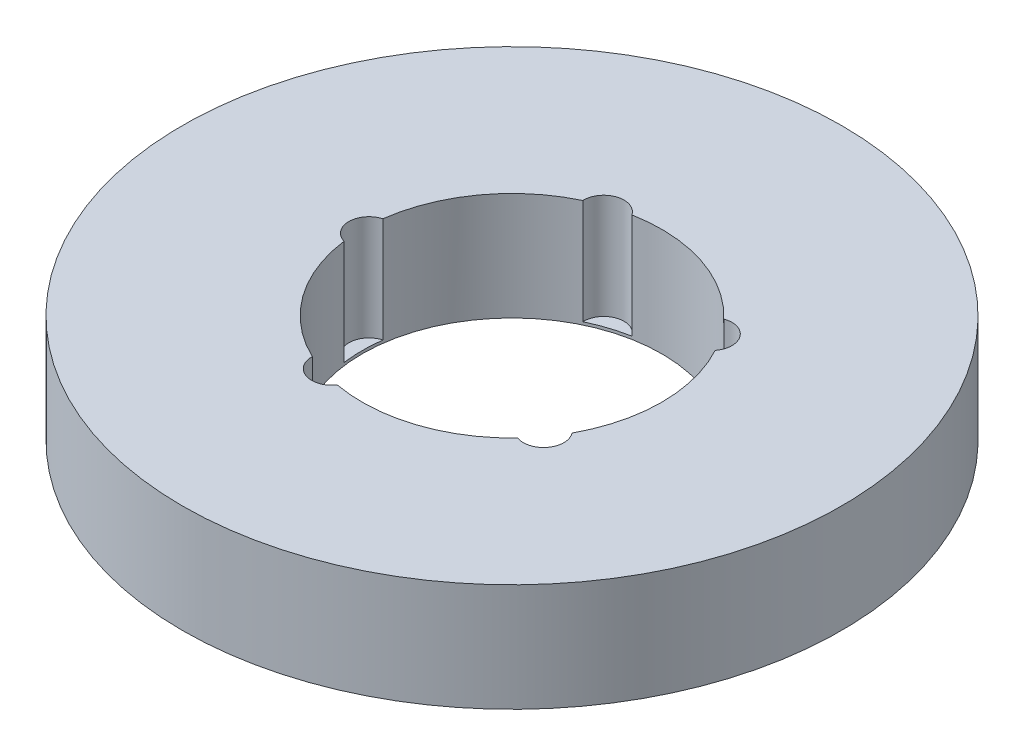
ISO-10303-21;
HEADER;
FILE_DESCRIPTION(('STEP AP214'),'2;1');
FILE_NAME('part.step','',(''),(''),'','','');
FILE_SCHEMA(('AUTOMOTIVE_DESIGN { 1 0 10303 214 1 1 1 1 }'));
ENDSEC;
DATA;
#1=APPLICATION_CONTEXT('core data for automotive mechanical design processes');
#2=APPLICATION_PROTOCOL_DEFINITION('international standard','automotive_design',2000,#1);
#3=PRODUCT_CONTEXT('',#1,'mechanical');
#4=PRODUCT('Part','Part','',(#3));
#5=PRODUCT_RELATED_PRODUCT_CATEGORY('part','',(#4));
#6=PRODUCT_DEFINITION_FORMATION('','',#4);
#7=PRODUCT_DEFINITION_CONTEXT('part definition',#1,'design');
#8=PRODUCT_DEFINITION('design','',#6,#7);
#9=PRODUCT_DEFINITION_SHAPE('','',#8);
#10=(LENGTH_UNIT() NAMED_UNIT(*) SI_UNIT(.MILLI.,.METRE.));
#11=(NAMED_UNIT(*) PLANE_ANGLE_UNIT() SI_UNIT($,.RADIAN.));
#12=(NAMED_UNIT(*) SI_UNIT($,.STERADIAN.) SOLID_ANGLE_UNIT());
#13=UNCERTAINTY_MEASURE_WITH_UNIT(LENGTH_MEASURE(1.E-05),#10,'distance_accuracy_value','');
#14=(GEOMETRIC_REPRESENTATION_CONTEXT(3) GLOBAL_UNCERTAINTY_ASSIGNED_CONTEXT((#13)) GLOBAL_UNIT_ASSIGNED_CONTEXT((#10,
#11,#12)) REPRESENTATION_CONTEXT('',''));
#15=CARTESIAN_POINT('',(0.,0.,0.));
#16=DIRECTION('',(0.,0.,1.));
#17=DIRECTION('',(1.,0.,0.));
#18=AXIS2_PLACEMENT_3D('',#15,#16,#17);
#19=CARTESIAN_POINT('',(0.,27.,0.));
#20=DIRECTION('',(0.,-1.,0.));
#21=DIRECTION('',(0.,0.,-1.));
#22=AXIS2_PLACEMENT_3D('',#19,#20,#21);
#23=CYLINDRICAL_SURFACE('',#22,82.5);
#24=CARTESIAN_POINT('',(0.,27.,0.));
#25=DIRECTION('',(0.,1.,0.));
#26=DIRECTION('',(0.,0.,1.));
#27=AXIS2_PLACEMENT_3D('',#24,#25,#26);
#28=CIRCLE('',#27,82.5);
#29=CARTESIAN_POINT('',(0.,27.,82.5));
#30=VERTEX_POINT('',#29);
#31=EDGE_CURVE('E159',#30,#30,#28,.T.);
#32=ORIENTED_EDGE('',*,*,#31,.F.);
#33=EDGE_LOOP('',(#32));
#34=FACE_BOUND('',#33,.T.);
#35=CARTESIAN_POINT('',(0.,0.,0.));
#36=DIRECTION('',(0.,1.,0.));
#37=DIRECTION('',(0.,0.,1.));
#38=AXIS2_PLACEMENT_3D('',#35,#36,#37);
#39=CIRCLE('',#38,82.5);
#40=CARTESIAN_POINT('',(0.,0.,82.5));
#41=VERTEX_POINT('',#40);
#42=EDGE_CURVE('E152',#41,#41,#39,.T.);
#43=ORIENTED_EDGE('',*,*,#42,.T.);
#44=EDGE_LOOP('',(#43));
#45=FACE_BOUND('',#44,.T.);
#46=ADVANCED_FACE('F39',(#34,#45),#23,.T.);
#47=CARTESIAN_POINT('',(0.,27.,0.));
#48=DIRECTION('',(0.,1.,0.));
#49=DIRECTION('',(0.,0.,1.));
#50=AXIS2_PLACEMENT_3D('',#47,#48,#49);
#51=PLANE('',#50);
#52=CARTESIAN_POINT('',(-11.0580663244745,27.,34.0332286798276));
#53=DIRECTION('',(0.,1.,0.));
#54=DIRECTION('',(0.951056516295155,0.,0.309016994374945));
#55=AXIS2_PLACEMENT_3D('',#52,#53,#54);
#56=CIRCLE('',#55,5.06944464076834);
#57=CARTESIAN_POINT('',(-16.1244245333742,27.,33.8563573567435));
#58=VERTEX_POINT('',#57);
#59=CARTESIAN_POINT('',(-6.85533407862134,27.,36.8680674116571));
#60=VERTEX_POINT('',#59);
#61=EDGE_CURVE('E192',#58,#60,#56,.T.);
#62=ORIENTED_EDGE('',*,*,#61,.F.);
#63=CARTESIAN_POINT('',(0.,27.,0.));
#64=DIRECTION('',(0.,1.,0.));
#65=DIRECTION('',(0.,0.,1.));
#66=AXIS2_PLACEMENT_3D('',#63,#64,#65);
#67=CIRCLE('',#66,37.5);
#68=CARTESIAN_POINT('',(-37.1820304874772,27.,4.87304923311006));
#69=VERTEX_POINT('',#68);
#70=EDGE_CURVE('E147',#69,#58,#67,.T.);
#71=ORIENTED_EDGE('',*,*,#70,.F.);
#72=CARTESIAN_POINT('',(-35.784654325701,27.,0.));
#73=DIRECTION('',(0.,1.,0.));
#74=DIRECTION('',(0.,0.,1.));
#75=AXIS2_PLACEMENT_3D('',#72,#73,#74);
#76=CIRCLE('',#75,5.06944464076834);
#77=CARTESIAN_POINT('',(-37.1820304874772,27.,-4.87304923311006));
#78=VERTEX_POINT('',#77);
#79=EDGE_CURVE('E154',#78,#69,#76,.T.);
#80=ORIENTED_EDGE('',*,*,#79,.F.);
#81=CARTESIAN_POINT('',(-16.1244245333747,27.,-33.8563573567433));
#82=VERTEX_POINT('',#81);
#83=EDGE_CURVE('E136',#82,#78,#67,.T.);
#84=ORIENTED_EDGE('',*,*,#83,.F.);
#85=CARTESIAN_POINT('',(-11.058066324475,27.,-34.0332286798274));
#86=DIRECTION('',(0.,1.,0.));
#87=DIRECTION('',(-0.95105651629515,0.,0.309016994374958));
#88=AXIS2_PLACEMENT_3D('',#85,#86,#87);
#89=CIRCLE('',#88,5.06944464076834);
#90=CARTESIAN_POINT('',(-6.85533407862186,27.,-36.868067411657));
#91=VERTEX_POINT('',#90);
#92=EDGE_CURVE('E117',#91,#82,#89,.T.);
#93=ORIENTED_EDGE('',*,*,#92,.F.);
#94=CARTESIAN_POINT('',(27.216588076819,27.,-25.7974288148403));
#95=VERTEX_POINT('',#94);
#96=EDGE_CURVE('E133',#95,#91,#67,.T.);
#97=ORIENTED_EDGE('',*,*,#96,.F.);
#98=CARTESIAN_POINT('',(28.9503934873249,27.,-21.0336920710314));
#99=DIRECTION('',(0.,1.,0.));
#100=DIRECTION('',(-0.58778525229248,0.,-0.809016994374942));
#101=AXIS2_PLACEMENT_3D('',#98,#99,#100);
#102=CIRCLE('',#101,5.06944464076834);
#103=CARTESIAN_POINT('',(32.9452010226536,27.,-17.9126695268167));
#104=VERTEX_POINT('',#103);
#105=EDGE_CURVE('E333',#104,#95,#102,.T.);
#106=ORIENTED_EDGE('',*,*,#105,.F.);
#107=CARTESIAN_POINT('',(32.9452010226538,27.,17.9126695268162));
#108=VERTEX_POINT('',#107);
#109=EDGE_CURVE('E144',#108,#104,#67,.T.);
#110=ORIENTED_EDGE('',*,*,#109,.F.);
#111=CARTESIAN_POINT('',(28.9503934873252,27.,21.033692071031));
#112=DIRECTION('',(0.,1.,0.));
#113=DIRECTION('',(0.587785252292469,0.,-0.809016994374951));
#114=AXIS2_PLACEMENT_3D('',#111,#112,#113);
#115=CIRCLE('',#114,5.06944464076834);
#116=CARTESIAN_POINT('',(27.2165880768194,27.,25.7974288148399));
#117=VERTEX_POINT('',#116);
#118=EDGE_CURVE('E328',#117,#108,#115,.T.);
#119=ORIENTED_EDGE('',*,*,#118,.F.);
#120=EDGE_CURVE('E146',#60,#117,#67,.T.);
#121=ORIENTED_EDGE('',*,*,#120,.F.);
#122=EDGE_LOOP('',(#62,#71,#80,#84,#93,#97,#106,#110,#119,#121));
#123=FACE_BOUND('',#122,.T.);
#124=ORIENTED_EDGE('',*,*,#31,.T.);
#125=EDGE_LOOP('',(#124));
#126=FACE_BOUND('',#125,.T.);
#127=ADVANCED_FACE('F131',(#123,#126),#51,.T.);
#128=CARTESIAN_POINT('',(0.,0.,0.));
#129=DIRECTION('',(0.,1.,0.));
#130=DIRECTION('',(0.,0.,1.));
#131=AXIS2_PLACEMENT_3D('',#128,#129,#130);
#132=PLANE('',#131);
#133=CARTESIAN_POINT('',(0.,0.,0.));
#134=DIRECTION('',(0.,1.,0.));
#135=DIRECTION('',(0.,0.,1.));
#136=AXIS2_PLACEMENT_3D('',#133,#134,#135);
#137=CIRCLE('',#136,37.5);
#138=CARTESIAN_POINT('',(0.,0.,37.5));
#139=VERTEX_POINT('',#138);
#140=EDGE_CURVE('E149',#139,#139,#137,.T.);
#141=ORIENTED_EDGE('',*,*,#140,.T.);
#142=EDGE_LOOP('',(#141));
#143=FACE_BOUND('',#142,.T.);
#144=ORIENTED_EDGE('',*,*,#42,.F.);
#145=EDGE_LOOP('',(#144));
#146=FACE_BOUND('',#145,.T.);
#147=ADVANCED_FACE('F209',(#143,#146),#132,.F.);
#148=CARTESIAN_POINT('',(0.,27.,0.));
#149=DIRECTION('',(0.,-1.,0.));
#150=DIRECTION('',(0.,0.,-1.));
#151=AXIS2_PLACEMENT_3D('',#148,#149,#150);
#152=CYLINDRICAL_SURFACE('',#151,37.5);
#153=DIRECTION('',(0.,1.,0.));
#154=VECTOR('',#153,1.);
#155=CARTESIAN_POINT('',(-16.1244245333742,13.8571036078466,33.8563573567435));
#156=LINE('',#155,#154);
#157=CARTESIAN_POINT('',(-16.1244245333742,0.714207215693301,33.8563573567435));
#158=VERTEX_POINT('',#157);
#159=EDGE_CURVE('E11',#158,#58,#156,.T.);
#160=ORIENTED_EDGE('',*,*,#159,.F.);
#161=CARTESIAN_POINT('',(0.,0.714207215693301,0.));
#162=DIRECTION('',(0.,1.,0.));
#163=DIRECTION('',(0.,0.,1.));
#164=AXIS2_PLACEMENT_3D('',#161,#162,#163);
#165=CIRCLE('',#164,37.5);
#166=CARTESIAN_POINT('',(-6.85533407862134,0.714207215693301,36.8680674116571));
#167=VERTEX_POINT('',#166);
#168=EDGE_CURVE('E187',#158,#167,#165,.T.);
#169=ORIENTED_EDGE('',*,*,#168,.T.);
#170=DIRECTION('',(0.,1.,0.));
#171=VECTOR('',#170,1.);
#172=CARTESIAN_POINT('',(-6.85533407862135,13.8571036078466,36.8680674116571));
#173=LINE('',#172,#171);
#174=EDGE_CURVE('E46',#60,#167,#173,.F.);
#175=ORIENTED_EDGE('',*,*,#174,.F.);
#176=ORIENTED_EDGE('',*,*,#120,.T.);
#177=DIRECTION('',(0.,1.,0.));
#178=VECTOR('',#177,1.);
#179=CARTESIAN_POINT('',(27.2165880768194,13.8571036078466,25.7974288148399));
#180=LINE('',#179,#178);
#181=CARTESIAN_POINT('',(27.2165880768194,0.714207215693301,25.7974288148399));
#182=VERTEX_POINT('',#181);
#183=EDGE_CURVE('E186',#182,#117,#180,.T.);
#184=ORIENTED_EDGE('',*,*,#183,.F.);
#185=CARTESIAN_POINT('',(0.,0.714207215693301,0.));
#186=DIRECTION('',(0.,1.,0.));
#187=DIRECTION('',(0.,0.,1.));
#188=AXIS2_PLACEMENT_3D('',#185,#186,#187);
#189=CIRCLE('',#188,37.5);
#190=CARTESIAN_POINT('',(32.9452010226538,0.714207215693301,17.9126695268162));
#191=VERTEX_POINT('',#190);
#192=EDGE_CURVE('E182',#182,#191,#189,.T.);
#193=ORIENTED_EDGE('',*,*,#192,.T.);
#194=DIRECTION('',(0.,1.,0.));
#195=VECTOR('',#194,1.);
#196=CARTESIAN_POINT('',(32.9452010226538,13.8571036078466,17.9126695268162));
#197=LINE('',#196,#195);
#198=EDGE_CURVE('E184',#108,#191,#197,.F.);
#199=ORIENTED_EDGE('',*,*,#198,.F.);
#200=ORIENTED_EDGE('',*,*,#109,.T.);
#201=DIRECTION('',(0.,1.,0.));
#202=VECTOR('',#201,1.);
#203=CARTESIAN_POINT('',(32.9452010226536,13.8571036078466,-17.9126695268167));
#204=LINE('',#203,#202);
#205=CARTESIAN_POINT('',(32.9452010226536,0.714207215693301,-17.9126695268167));
#206=VERTEX_POINT('',#205);
#207=EDGE_CURVE('E178',#206,#104,#204,.T.);
#208=ORIENTED_EDGE('',*,*,#207,.F.);
#209=CARTESIAN_POINT('',(0.,0.714207215693301,0.));
#210=DIRECTION('',(0.,1.,0.));
#211=DIRECTION('',(0.,0.,1.));
#212=AXIS2_PLACEMENT_3D('',#209,#210,#211);
#213=CIRCLE('',#212,37.5);
#214=CARTESIAN_POINT('',(27.216588076819,0.714207215693301,-25.7974288148403));
#215=VERTEX_POINT('',#214);
#216=EDGE_CURVE('E123',#206,#215,#213,.T.);
#217=ORIENTED_EDGE('',*,*,#216,.T.);
#218=DIRECTION('',(0.,1.,0.));
#219=VECTOR('',#218,1.);
#220=CARTESIAN_POINT('',(27.216588076819,13.8571036078466,-25.7974288148403));
#221=LINE('',#220,#219);
#222=EDGE_CURVE('E145',#95,#215,#221,.F.);
#223=ORIENTED_EDGE('',*,*,#222,.F.);
#224=ORIENTED_EDGE('',*,*,#96,.T.);
#225=DIRECTION('',(0.,1.,0.));
#226=VECTOR('',#225,1.);
#227=CARTESIAN_POINT('',(-6.85533407862187,13.8571036078466,-36.868067411657));
#228=LINE('',#227,#226);
#229=CARTESIAN_POINT('',(-6.85533407862186,0.714207215693301,-36.868067411657));
#230=VERTEX_POINT('',#229);
#231=EDGE_CURVE('E111',#230,#91,#228,.T.);
#232=ORIENTED_EDGE('',*,*,#231,.F.);
#233=CARTESIAN_POINT('',(0.,0.714207215693301,0.));
#234=DIRECTION('',(0.,1.,0.));
#235=DIRECTION('',(0.,0.,1.));
#236=AXIS2_PLACEMENT_3D('',#233,#234,#235);
#237=CIRCLE('',#236,37.5);
#238=CARTESIAN_POINT('',(-16.1244245333747,0.714207215693301,-33.8563573567433));
#239=VERTEX_POINT('',#238);
#240=EDGE_CURVE('E173',#230,#239,#237,.T.);
#241=ORIENTED_EDGE('',*,*,#240,.T.);
#242=DIRECTION('',(0.,1.,0.));
#243=VECTOR('',#242,1.);
#244=CARTESIAN_POINT('',(-16.1244245333747,13.8571036078466,-33.8563573567433));
#245=LINE('',#244,#243);
#246=EDGE_CURVE('E124',#82,#239,#245,.F.);
#247=ORIENTED_EDGE('',*,*,#246,.F.);
#248=ORIENTED_EDGE('',*,*,#83,.T.);
#249=DIRECTION('',(0.,1.,0.));
#250=VECTOR('',#249,1.);
#251=CARTESIAN_POINT('',(-37.1820304874772,13.8571036078466,-4.87304923311006));
#252=LINE('',#251,#250);
#253=CARTESIAN_POINT('',(-37.1820304874772,0.714207215693301,-4.87304923311006));
#254=VERTEX_POINT('',#253);
#255=EDGE_CURVE('E171',#254,#78,#252,.T.);
#256=ORIENTED_EDGE('',*,*,#255,.F.);
#257=CARTESIAN_POINT('',(0.,0.714207215693301,0.));
#258=DIRECTION('',(0.,1.,0.));
#259=DIRECTION('',(0.,0.,1.));
#260=AXIS2_PLACEMENT_3D('',#257,#258,#259);
#261=CIRCLE('',#260,37.5);
#262=CARTESIAN_POINT('',(-37.1820304874772,0.714207215693301,4.87304923311006));
#263=VERTEX_POINT('',#262);
#264=EDGE_CURVE('E162',#254,#263,#261,.T.);
#265=ORIENTED_EDGE('',*,*,#264,.T.);
#266=DIRECTION('',(0.,1.,0.));
#267=VECTOR('',#266,1.);
#268=CARTESIAN_POINT('',(-37.1820304874772,13.8571036078466,4.87304923311006));
#269=LINE('',#268,#267);
#270=EDGE_CURVE('E169',#69,#263,#269,.F.);
#271=ORIENTED_EDGE('',*,*,#270,.F.);
#272=ORIENTED_EDGE('',*,*,#70,.T.);
#273=EDGE_LOOP('',(#160,#169,#175,#176,#184,#193,#199,#200,#208,#217,#223,#224,#232,#241,#247,
#248,#256,#265,#271,#272));
#274=FACE_BOUND('',#273,.T.);
#275=ORIENTED_EDGE('',*,*,#140,.F.);
#276=EDGE_LOOP('',(#275));
#277=FACE_BOUND('',#276,.T.);
#278=ADVANCED_FACE('F139',(#274,#277),#152,.F.);
#279=CARTESIAN_POINT('',(-35.784654325701,0.714207215693301,0.));
#280=DIRECTION('',(0.,1.,0.));
#281=DIRECTION('',(0.,0.,1.));
#282=AXIS2_PLACEMENT_3D('',#279,#280,#281);
#283=CYLINDRICAL_SURFACE('',#282,5.06944464076834);
#284=ORIENTED_EDGE('',*,*,#255,.T.);
#285=ORIENTED_EDGE('',*,*,#79,.T.);
#286=ORIENTED_EDGE('',*,*,#270,.T.);
#287=CARTESIAN_POINT('',(-35.784654325701,0.714207215693301,0.));
#288=DIRECTION('',(0.,1.,0.));
#289=DIRECTION('',(0.,0.,1.));
#290=AXIS2_PLACEMENT_3D('',#287,#288,#289);
#291=CIRCLE('',#290,5.06944464076834);
#292=EDGE_CURVE('E157',#254,#263,#291,.T.);
#293=ORIENTED_EDGE('',*,*,#292,.F.);
#294=EDGE_LOOP('',(#284,#285,#286,#293));
#295=FACE_BOUND('',#294,.T.);
#296=ADVANCED_FACE('F222',(#295),#283,.F.);
#297=CARTESIAN_POINT('',(-35.784654325701,0.714207215693301,0.));
#298=DIRECTION('',(0.,1.,0.));
#299=DIRECTION('',(0.,0.,1.));
#300=AXIS2_PLACEMENT_3D('',#297,#298,#299);
#301=PLANE('',#300);
#302=ORIENTED_EDGE('',*,*,#292,.T.);
#303=ORIENTED_EDGE('',*,*,#264,.F.);
#304=EDGE_LOOP('',(#302,#303));
#305=FACE_BOUND('',#304,.T.);
#306=ADVANCED_FACE('F223',(#305),#301,.T.);
#307=CARTESIAN_POINT('',(-11.058066324475,0.714207215693301,-34.0332286798274));
#308=DIRECTION('',(0.,1.,0.));
#309=DIRECTION('',(0.,0.,1.));
#310=AXIS2_PLACEMENT_3D('',#307,#308,#309);
#311=CYLINDRICAL_SURFACE('',#310,5.06944464076834);
#312=ORIENTED_EDGE('',*,*,#231,.T.);
#313=ORIENTED_EDGE('',*,*,#92,.T.);
#314=ORIENTED_EDGE('',*,*,#246,.T.);
#315=CARTESIAN_POINT('',(-11.058066324475,0.714207215693301,-34.0332286798274));
#316=DIRECTION('',(0.,1.,0.));
#317=DIRECTION('',(-0.95105651629515,0.,0.309016994374958));
#318=AXIS2_PLACEMENT_3D('',#315,#316,#317);
#319=CIRCLE('',#318,5.06944464076834);
#320=EDGE_CURVE('E119',#230,#239,#319,.T.);
#321=ORIENTED_EDGE('',*,*,#320,.F.);
#322=EDGE_LOOP('',(#312,#313,#314,#321));
#323=FACE_BOUND('',#322,.T.);
#324=ADVANCED_FACE('F116',(#323),#311,.F.);
#325=CARTESIAN_POINT('',(-11.058066324475,0.714207215693301,-34.0332286798274));
#326=DIRECTION('',(0.,1.,0.));
#327=DIRECTION('',(-0.95105651629515,0.,0.309016994374958));
#328=AXIS2_PLACEMENT_3D('',#325,#326,#327);
#329=PLANE('',#328);
#330=ORIENTED_EDGE('',*,*,#320,.T.);
#331=ORIENTED_EDGE('',*,*,#240,.F.);
#332=EDGE_LOOP('',(#330,#331));
#333=FACE_BOUND('',#332,.T.);
#334=ADVANCED_FACE('F235',(#333),#329,.T.);
#335=CARTESIAN_POINT('',(28.9503934873249,0.714207215693301,-21.0336920710314));
#336=DIRECTION('',(0.,1.,0.));
#337=DIRECTION('',(0.,0.,1.));
#338=AXIS2_PLACEMENT_3D('',#335,#336,#337);
#339=CYLINDRICAL_SURFACE('',#338,5.06944464076834);
#340=ORIENTED_EDGE('',*,*,#207,.T.);
#341=ORIENTED_EDGE('',*,*,#105,.T.);
#342=ORIENTED_EDGE('',*,*,#222,.T.);
#343=CARTESIAN_POINT('',(28.9503934873249,0.714207215693301,-21.0336920710314));
#344=DIRECTION('',(0.,1.,0.));
#345=DIRECTION('',(-0.58778525229248,0.,-0.809016994374942));
#346=AXIS2_PLACEMENT_3D('',#343,#344,#345);
#347=CIRCLE('',#346,5.06944464076834);
#348=EDGE_CURVE('E335',#206,#215,#347,.T.);
#349=ORIENTED_EDGE('',*,*,#348,.F.);
#350=EDGE_LOOP('',(#340,#341,#342,#349));
#351=FACE_BOUND('',#350,.T.);
#352=ADVANCED_FACE('F234',(#351),#339,.F.);
#353=CARTESIAN_POINT('',(28.9503934873249,0.714207215693301,-21.0336920710314));
#354=DIRECTION('',(0.,1.,0.));
#355=DIRECTION('',(-0.58778525229248,0.,-0.809016994374942));
#356=AXIS2_PLACEMENT_3D('',#353,#354,#355);
#357=PLANE('',#356);
#358=ORIENTED_EDGE('',*,*,#348,.T.);
#359=ORIENTED_EDGE('',*,*,#216,.F.);
#360=EDGE_LOOP('',(#358,#359));
#361=FACE_BOUND('',#360,.T.);
#362=ADVANCED_FACE('F239',(#361),#357,.T.);
#363=CARTESIAN_POINT('',(28.9503934873252,0.714207215693301,21.033692071031));
#364=DIRECTION('',(0.,1.,0.));
#365=DIRECTION('',(0.,0.,1.));
#366=AXIS2_PLACEMENT_3D('',#363,#364,#365);
#367=CYLINDRICAL_SURFACE('',#366,5.06944464076834);
#368=ORIENTED_EDGE('',*,*,#183,.T.);
#369=ORIENTED_EDGE('',*,*,#118,.T.);
#370=ORIENTED_EDGE('',*,*,#198,.T.);
#371=CARTESIAN_POINT('',(28.9503934873252,0.714207215693301,21.033692071031));
#372=DIRECTION('',(0.,1.,0.));
#373=DIRECTION('',(0.587785252292469,0.,-0.809016994374951));
#374=AXIS2_PLACEMENT_3D('',#371,#372,#373);
#375=CIRCLE('',#374,5.06944464076834);
#376=EDGE_CURVE('E56',#182,#191,#375,.T.);
#377=ORIENTED_EDGE('',*,*,#376,.F.);
#378=EDGE_LOOP('',(#368,#369,#370,#377));
#379=FACE_BOUND('',#378,.T.);
#380=ADVANCED_FACE('F242',(#379),#367,.F.);
#381=CARTESIAN_POINT('',(28.9503934873252,0.714207215693301,21.033692071031));
#382=DIRECTION('',(0.,1.,0.));
#383=DIRECTION('',(0.587785252292469,0.,-0.809016994374951));
#384=AXIS2_PLACEMENT_3D('',#381,#382,#383);
#385=PLANE('',#384);
#386=ORIENTED_EDGE('',*,*,#376,.T.);
#387=ORIENTED_EDGE('',*,*,#192,.F.);
#388=EDGE_LOOP('',(#386,#387));
#389=FACE_BOUND('',#388,.T.);
#390=ADVANCED_FACE('F205',(#389),#385,.T.);
#391=CARTESIAN_POINT('',(-11.0580663244745,0.714207215693301,34.0332286798276));
#392=DIRECTION('',(0.,1.,0.));
#393=DIRECTION('',(0.,0.,1.));
#394=AXIS2_PLACEMENT_3D('',#391,#392,#393);
#395=CYLINDRICAL_SURFACE('',#394,5.06944464076834);
#396=ORIENTED_EDGE('',*,*,#159,.T.);
#397=ORIENTED_EDGE('',*,*,#61,.T.);
#398=ORIENTED_EDGE('',*,*,#174,.T.);
#399=CARTESIAN_POINT('',(-11.0580663244745,0.714207215693301,34.0332286798276));
#400=DIRECTION('',(0.,1.,0.));
#401=DIRECTION('',(0.951056516295155,0.,0.309016994374945));
#402=AXIS2_PLACEMENT_3D('',#399,#400,#401);
#403=CIRCLE('',#402,5.06944464076834);
#404=EDGE_CURVE('E55',#158,#167,#403,.T.);
#405=ORIENTED_EDGE('',*,*,#404,.F.);
#406=EDGE_LOOP('',(#396,#397,#398,#405));
#407=FACE_BOUND('',#406,.T.);
#408=ADVANCED_FACE('F195',(#407),#395,.F.);
#409=CARTESIAN_POINT('',(-11.0580663244745,0.714207215693301,34.0332286798276));
#410=DIRECTION('',(0.,1.,0.));
#411=DIRECTION('',(0.951056516295155,0.,0.309016994374945));
#412=AXIS2_PLACEMENT_3D('',#409,#410,#411);
#413=PLANE('',#412);
#414=ORIENTED_EDGE('',*,*,#404,.T.);
#415=ORIENTED_EDGE('',*,*,#168,.F.);
#416=EDGE_LOOP('',(#414,#415));
#417=FACE_BOUND('',#416,.T.);
#418=ADVANCED_FACE('F198',(#417),#413,.T.);
#419=CLOSED_SHELL('',(#46,#127,#147,#278,#296,#306,#324,#334,#352,#362,#380,#390,#408,#418));
#420=MANIFOLD_SOLID_BREP('B2',#419);
#421=ADVANCED_BREP_SHAPE_REPRESENTATION('',(#18,#420),#14);
#422=SHAPE_DEFINITION_REPRESENTATION(#9,#421);
ENDSEC;
END-ISO-10303-21;
